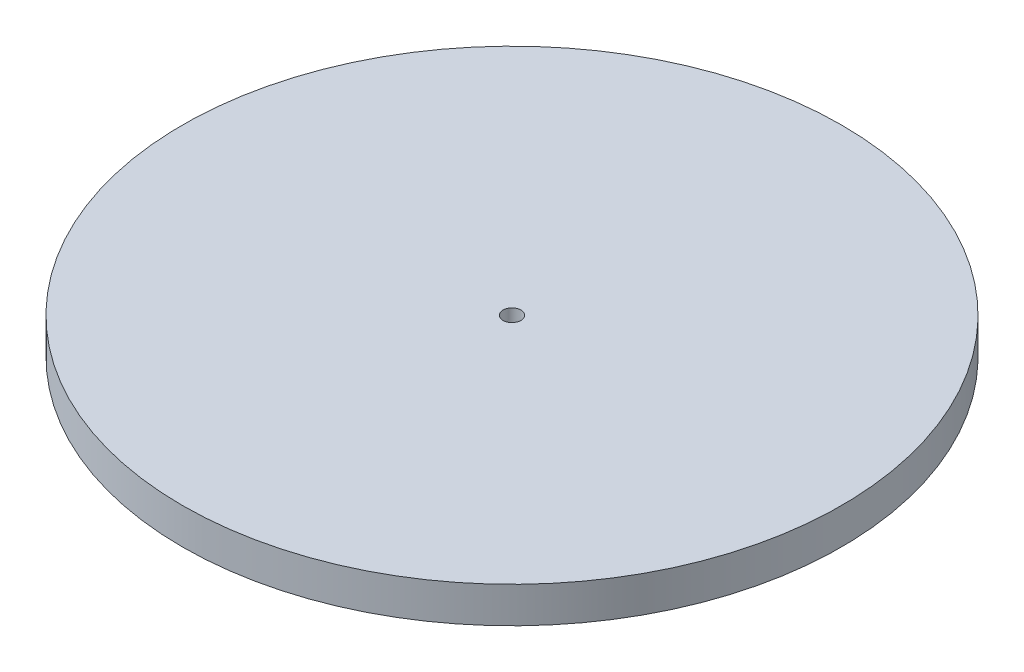
ISO-10303-21;
HEADER;
FILE_DESCRIPTION(('STEP AP214'),'2;1');
FILE_NAME('part.step','',(''),(''),'','','');
FILE_SCHEMA(('AUTOMOTIVE_DESIGN { 1 0 10303 214 1 1 1 1 }'));
ENDSEC;
DATA;
#1=APPLICATION_CONTEXT('core data for automotive mechanical design processes');
#2=APPLICATION_PROTOCOL_DEFINITION('international standard','automotive_design',2000,#1);
#3=PRODUCT_CONTEXT('',#1,'mechanical');
#4=PRODUCT('Part','Part','',(#3));
#5=PRODUCT_RELATED_PRODUCT_CATEGORY('part','',(#4));
#6=PRODUCT_DEFINITION_FORMATION('','',#4);
#7=PRODUCT_DEFINITION_CONTEXT('part definition',#1,'design');
#8=PRODUCT_DEFINITION('design','',#6,#7);
#9=PRODUCT_DEFINITION_SHAPE('','',#8);
#10=(LENGTH_UNIT() NAMED_UNIT(*) SI_UNIT(.MILLI.,.METRE.));
#11=(NAMED_UNIT(*) PLANE_ANGLE_UNIT() SI_UNIT($,.RADIAN.));
#12=(NAMED_UNIT(*) SI_UNIT($,.STERADIAN.) SOLID_ANGLE_UNIT());
#13=UNCERTAINTY_MEASURE_WITH_UNIT(LENGTH_MEASURE(1.E-05),#10,'distance_accuracy_value','');
#14=(GEOMETRIC_REPRESENTATION_CONTEXT(3) GLOBAL_UNCERTAINTY_ASSIGNED_CONTEXT((#13)) GLOBAL_UNIT_ASSIGNED_CONTEXT((#10,
#11,#12)) REPRESENTATION_CONTEXT('',''));
#15=CARTESIAN_POINT('',(0.,0.,0.));
#16=DIRECTION('',(0.,0.,1.));
#17=DIRECTION('',(1.,0.,0.));
#18=AXIS2_PLACEMENT_3D('',#15,#16,#17);
#19=CARTESIAN_POINT('',(0.,3.,0.));
#20=DIRECTION('',(0.,1.,0.));
#21=DIRECTION('',(0.,0.,1.));
#22=AXIS2_PLACEMENT_3D('',#19,#20,#21);
#23=PLANE('',#22);
#24=CARTESIAN_POINT('',(0.,3.,0.));
#25=DIRECTION('',(0.,1.,0.));
#26=DIRECTION('',(0.,0.,1.));
#27=AXIS2_PLACEMENT_3D('',#24,#25,#26);
#28=CIRCLE('',#27,27.5);
#29=CARTESIAN_POINT('',(0.,3.,27.5));
#30=VERTEX_POINT('',#29);
#31=EDGE_CURVE('E10',#30,#30,#28,.T.);
#32=ORIENTED_EDGE('',*,*,#31,.T.);
#33=EDGE_LOOP('',(#32));
#34=FACE_BOUND('',#33,.T.);
#35=CARTESIAN_POINT('',(0.,3.,0.));
#36=DIRECTION('',(0.,1.,0.));
#37=DIRECTION('',(0.,0.,1.));
#38=AXIS2_PLACEMENT_3D('',#35,#36,#37);
#39=CIRCLE('',#38,0.75);
#40=CARTESIAN_POINT('',(0.,3.,0.75));
#41=VERTEX_POINT('',#40);
#42=EDGE_CURVE('E41',#41,#41,#39,.T.);
#43=ORIENTED_EDGE('',*,*,#42,.F.);
#44=EDGE_LOOP('',(#43));
#45=FACE_BOUND('',#44,.T.);
#46=ADVANCED_FACE('F30',(#34,#45),#23,.T.);
#47=CARTESIAN_POINT('',(0.,0.,0.));
#48=DIRECTION('',(0.,1.,0.));
#49=DIRECTION('',(0.,0.,1.));
#50=AXIS2_PLACEMENT_3D('',#47,#48,#49);
#51=PLANE('',#50);
#52=CARTESIAN_POINT('',(0.,0.,0.));
#53=DIRECTION('',(0.,1.,0.));
#54=DIRECTION('',(0.,0.,1.));
#55=AXIS2_PLACEMENT_3D('',#52,#53,#54);
#56=CIRCLE('',#55,27.5);
#57=CARTESIAN_POINT('',(0.,0.,27.5));
#58=VERTEX_POINT('',#57);
#59=EDGE_CURVE('E34',#58,#58,#56,.T.);
#60=ORIENTED_EDGE('',*,*,#59,.F.);
#61=EDGE_LOOP('',(#60));
#62=FACE_BOUND('',#61,.T.);
#63=CARTESIAN_POINT('',(0.,0.,0.));
#64=DIRECTION('',(0.,1.,0.));
#65=DIRECTION('',(0.,0.,1.));
#66=AXIS2_PLACEMENT_3D('',#63,#64,#65);
#67=CIRCLE('',#66,0.75);
#68=CARTESIAN_POINT('',(0.,0.,0.75));
#69=VERTEX_POINT('',#68);
#70=EDGE_CURVE('E43',#69,#69,#67,.T.);
#71=ORIENTED_EDGE('',*,*,#70,.T.);
#72=EDGE_LOOP('',(#71));
#73=FACE_BOUND('',#72,.T.);
#74=ADVANCED_FACE('F53',(#62,#73),#51,.F.);
#75=CARTESIAN_POINT('',(0.,3.,0.));
#76=DIRECTION('',(0.,-1.,0.));
#77=DIRECTION('',(0.,0.,-1.));
#78=AXIS2_PLACEMENT_3D('',#75,#76,#77);
#79=CYLINDRICAL_SURFACE('',#78,27.5);
#80=ORIENTED_EDGE('',*,*,#31,.F.);
#81=EDGE_LOOP('',(#80));
#82=FACE_BOUND('',#81,.T.);
#83=ORIENTED_EDGE('',*,*,#59,.T.);
#84=EDGE_LOOP('',(#83));
#85=FACE_BOUND('',#84,.T.);
#86=ADVANCED_FACE('F32',(#82,#85),#79,.T.);
#87=CARTESIAN_POINT('',(0.,3.,0.));
#88=DIRECTION('',(0.,-1.,0.));
#89=DIRECTION('',(0.,0.,-1.));
#90=AXIS2_PLACEMENT_3D('',#87,#88,#89);
#91=CYLINDRICAL_SURFACE('',#90,0.75);
#92=ORIENTED_EDGE('',*,*,#42,.T.);
#93=EDGE_LOOP('',(#92));
#94=FACE_BOUND('',#93,.T.);
#95=ORIENTED_EDGE('',*,*,#70,.F.);
#96=EDGE_LOOP('',(#95));
#97=FACE_BOUND('',#96,.T.);
#98=ADVANCED_FACE('F49',(#94,#97),#91,.F.);
#99=CLOSED_SHELL('',(#46,#74,#86,#98));
#100=MANIFOLD_SOLID_BREP('B2',#99);
#101=ADVANCED_BREP_SHAPE_REPRESENTATION('',(#18,#100),#14);
#102=SHAPE_DEFINITION_REPRESENTATION(#9,#101);
ENDSEC;
END-ISO-10303-21;
